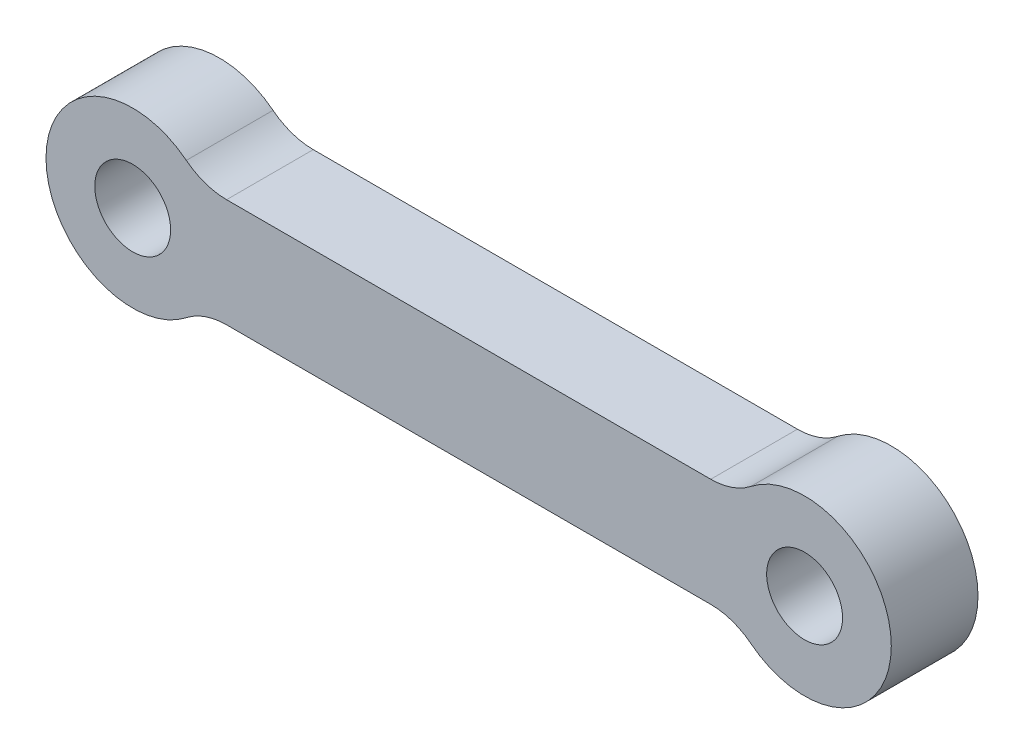
ISO-10303-21;
HEADER;
FILE_DESCRIPTION(('STEP AP214'),'2;1');
FILE_NAME('part.step','',(''),(''),'','','');
FILE_SCHEMA(('AUTOMOTIVE_DESIGN { 1 0 10303 214 1 1 1 1 }'));
ENDSEC;
DATA;
#1=APPLICATION_CONTEXT('core data for automotive mechanical design processes');
#2=APPLICATION_PROTOCOL_DEFINITION('international standard','automotive_design',2000,#1);
#3=PRODUCT_CONTEXT('',#1,'mechanical');
#4=PRODUCT('Part','Part','',(#3));
#5=PRODUCT_RELATED_PRODUCT_CATEGORY('part','',(#4));
#6=PRODUCT_DEFINITION_FORMATION('','',#4);
#7=PRODUCT_DEFINITION_CONTEXT('part definition',#1,'design');
#8=PRODUCT_DEFINITION('design','',#6,#7);
#9=PRODUCT_DEFINITION_SHAPE('','',#8);
#10=(LENGTH_UNIT() NAMED_UNIT(*) SI_UNIT(.MILLI.,.METRE.));
#11=(NAMED_UNIT(*) PLANE_ANGLE_UNIT() SI_UNIT($,.RADIAN.));
#12=(NAMED_UNIT(*) SI_UNIT($,.STERADIAN.) SOLID_ANGLE_UNIT());
#13=UNCERTAINTY_MEASURE_WITH_UNIT(LENGTH_MEASURE(1.E-05),#10,'distance_accuracy_value','');
#14=(GEOMETRIC_REPRESENTATION_CONTEXT(3) GLOBAL_UNCERTAINTY_ASSIGNED_CONTEXT((#13)) GLOBAL_UNIT_ASSIGNED_CONTEXT((#10,
#11,#12)) REPRESENTATION_CONTEXT('',''));
#15=CARTESIAN_POINT('',(0.,0.,0.));
#16=DIRECTION('',(0.,0.,1.));
#17=DIRECTION('',(1.,0.,0.));
#18=AXIS2_PLACEMENT_3D('',#15,#16,#17);
#19=CARTESIAN_POINT('',(0.,-2.5,4.));
#20=DIRECTION('',(0.,1.,0.));
#21=DIRECTION('',(0.,0.,1.));
#22=AXIS2_PLACEMENT_3D('',#19,#20,#21);
#23=PLANE('',#22);
#24=DIRECTION('',(1.,0.,0.));
#25=VECTOR('',#24,1.);
#26=CARTESIAN_POINT('',(0.,-2.5,0.));
#27=LINE('',#26,#25);
#28=CARTESIAN_POINT('',(4.33012701892219,-2.5,0.));
#29=VERTEX_POINT('',#28);
#30=CARTESIAN_POINT('',(26.6698729810778,-2.5,0.));
#31=VERTEX_POINT('',#30);
#32=EDGE_CURVE('E137',#29,#31,#27,.T.);
#33=ORIENTED_EDGE('',*,*,#32,.T.);
#34=DIRECTION('',(0.,0.,1.));
#35=VECTOR('',#34,1.);
#36=CARTESIAN_POINT('',(26.6698729810778,-2.5,4.));
#37=LINE('',#36,#35);
#38=CARTESIAN_POINT('',(26.6698729810778,-2.5,4.));
#39=VERTEX_POINT('',#38);
#40=EDGE_CURVE('E113',#31,#39,#37,.T.);
#41=ORIENTED_EDGE('',*,*,#40,.T.);
#42=DIRECTION('',(1.,0.,0.));
#43=VECTOR('',#42,1.);
#44=CARTESIAN_POINT('',(0.,-2.5,4.));
#45=LINE('',#44,#43);
#46=CARTESIAN_POINT('',(4.33012701892219,-2.5,4.));
#47=VERTEX_POINT('',#46);
#48=EDGE_CURVE('E157',#47,#39,#45,.T.);
#49=ORIENTED_EDGE('',*,*,#48,.F.);
#50=DIRECTION('',(0.,0.,1.));
#51=VECTOR('',#50,1.);
#52=CARTESIAN_POINT('',(4.33012701892219,-2.5,0.));
#53=LINE('',#52,#51);
#54=EDGE_CURVE('E129',#47,#29,#53,.F.);
#55=ORIENTED_EDGE('',*,*,#54,.T.);
#56=EDGE_LOOP('',(#33,#41,#49,#55));
#57=FACE_BOUND('',#56,.T.);
#58=ADVANCED_FACE('F42',(#57),#23,.F.);
#59=CARTESIAN_POINT('',(31.,0.,4.));
#60=DIRECTION('',(0.,0.,-1.));
#61=DIRECTION('',(-1.,0.,0.));
#62=AXIS2_PLACEMENT_3D('',#59,#60,#61);
#63=CYLINDRICAL_SURFACE('',#62,4.00000000000001);
#64=CARTESIAN_POINT('',(31.,0.,4.));
#65=DIRECTION('',(0.,0.,1.));
#66=DIRECTION('',(1.,0.,0.));
#67=AXIS2_PLACEMENT_3D('',#64,#65,#66);
#68=CIRCLE('',#67,4.00000000000001);
#69=CARTESIAN_POINT('',(28.525641703473,-3.14285714285714,4.));
#70=VERTEX_POINT('',#69);
#71=CARTESIAN_POINT('',(28.525641703473,3.14285714285714,4.));
#72=VERTEX_POINT('',#71);
#73=EDGE_CURVE('E127',#70,#72,#68,.T.);
#74=ORIENTED_EDGE('',*,*,#73,.F.);
#75=DIRECTION('',(0.,0.,-1.));
#76=VECTOR('',#75,1.);
#77=CARTESIAN_POINT('',(28.525641703473,-3.14285714285714,4.));
#78=LINE('',#77,#76);
#79=CARTESIAN_POINT('',(28.525641703473,-3.14285714285714,0.));
#80=VERTEX_POINT('',#79);
#81=EDGE_CURVE('E112',#70,#80,#78,.T.);
#82=ORIENTED_EDGE('',*,*,#81,.T.);
#83=CARTESIAN_POINT('',(31.,0.,0.));
#84=DIRECTION('',(0.,0.,1.));
#85=DIRECTION('',(1.,0.,0.));
#86=AXIS2_PLACEMENT_3D('',#83,#84,#85);
#87=CIRCLE('',#86,4.00000000000001);
#88=CARTESIAN_POINT('',(28.525641703473,3.14285714285714,0.));
#89=VERTEX_POINT('',#88);
#90=EDGE_CURVE('E125',#80,#89,#87,.T.);
#91=ORIENTED_EDGE('',*,*,#90,.T.);
#92=DIRECTION('',(0.,0.,-1.));
#93=VECTOR('',#92,1.);
#94=CARTESIAN_POINT('',(28.525641703473,3.14285714285714,4.));
#95=LINE('',#94,#93);
#96=EDGE_CURVE('E130',#89,#72,#95,.F.);
#97=ORIENTED_EDGE('',*,*,#96,.T.);
#98=EDGE_LOOP('',(#74,#82,#91,#97));
#99=FACE_BOUND('',#98,.T.);
#100=ADVANCED_FACE('F124',(#99),#63,.T.);
#101=CARTESIAN_POINT('',(0.,2.5,4.));
#102=DIRECTION('',(0.,1.,0.));
#103=DIRECTION('',(0.,0.,1.));
#104=AXIS2_PLACEMENT_3D('',#101,#102,#103);
#105=PLANE('',#104);
#106=DIRECTION('',(1.,0.,0.));
#107=VECTOR('',#106,1.);
#108=CARTESIAN_POINT('',(0.,2.5,0.));
#109=LINE('',#108,#107);
#110=CARTESIAN_POINT('',(4.33012701892219,2.5,0.));
#111=VERTEX_POINT('',#110);
#112=CARTESIAN_POINT('',(26.6698729810778,2.5,0.));
#113=VERTEX_POINT('',#112);
#114=EDGE_CURVE('E136',#111,#113,#109,.T.);
#115=ORIENTED_EDGE('',*,*,#114,.F.);
#116=DIRECTION('',(0.,0.,-1.));
#117=VECTOR('',#116,1.);
#118=CARTESIAN_POINT('',(4.33012701892219,2.5,4.));
#119=LINE('',#118,#117);
#120=CARTESIAN_POINT('',(4.33012701892219,2.5,4.));
#121=VERTEX_POINT('',#120);
#122=EDGE_CURVE('E63',#111,#121,#119,.F.);
#123=ORIENTED_EDGE('',*,*,#122,.T.);
#124=DIRECTION('',(1.,0.,0.));
#125=VECTOR('',#124,1.);
#126=CARTESIAN_POINT('',(0.,2.5,4.));
#127=LINE('',#126,#125);
#128=CARTESIAN_POINT('',(26.6698729810778,2.5,4.));
#129=VERTEX_POINT('',#128);
#130=EDGE_CURVE('E203',#121,#129,#127,.T.);
#131=ORIENTED_EDGE('',*,*,#130,.T.);
#132=DIRECTION('',(0.,0.,-1.));
#133=VECTOR('',#132,1.);
#134=CARTESIAN_POINT('',(26.6698729810778,2.5,4.));
#135=LINE('',#134,#133);
#136=EDGE_CURVE('E173',#129,#113,#135,.T.);
#137=ORIENTED_EDGE('',*,*,#136,.T.);
#138=EDGE_LOOP('',(#115,#123,#131,#137));
#139=FACE_BOUND('',#138,.T.);
#140=ADVANCED_FACE('F228',(#139),#105,.T.);
#141=CARTESIAN_POINT('',(0.,0.,4.));
#142=DIRECTION('',(0.,0.,-1.));
#143=DIRECTION('',(-1.,0.,0.));
#144=AXIS2_PLACEMENT_3D('',#141,#142,#143);
#145=CYLINDRICAL_SURFACE('',#144,1.75);
#146=CARTESIAN_POINT('',(0.,0.,4.));
#147=DIRECTION('',(0.,0.,1.));
#148=DIRECTION('',(1.,0.,0.));
#149=AXIS2_PLACEMENT_3D('',#146,#147,#148);
#150=CIRCLE('',#149,1.75);
#151=CARTESIAN_POINT('',(1.75,0.,4.));
#152=VERTEX_POINT('',#151);
#153=EDGE_CURVE('E196',#152,#152,#150,.T.);
#154=ORIENTED_EDGE('',*,*,#153,.T.);
#155=EDGE_LOOP('',(#154));
#156=FACE_BOUND('',#155,.T.);
#157=CARTESIAN_POINT('',(0.,0.,0.));
#158=DIRECTION('',(0.,0.,1.));
#159=DIRECTION('',(1.,0.,0.));
#160=AXIS2_PLACEMENT_3D('',#157,#158,#159);
#161=CIRCLE('',#160,1.75);
#162=CARTESIAN_POINT('',(1.75,0.,0.));
#163=VERTEX_POINT('',#162);
#164=EDGE_CURVE('E149',#163,#163,#161,.T.);
#165=ORIENTED_EDGE('',*,*,#164,.F.);
#166=EDGE_LOOP('',(#165));
#167=FACE_BOUND('',#166,.T.);
#168=ADVANCED_FACE('F308',(#156,#167),#145,.F.);
#169=CARTESIAN_POINT('',(0.,0.,4.));
#170=DIRECTION('',(0.,0.,-1.));
#171=DIRECTION('',(-1.,0.,0.));
#172=AXIS2_PLACEMENT_3D('',#169,#170,#171);
#173=CYLINDRICAL_SURFACE('',#172,4.);
#174=CARTESIAN_POINT('',(0.,0.,0.));
#175=DIRECTION('',(0.,0.,1.));
#176=DIRECTION('',(1.,0.,0.));
#177=AXIS2_PLACEMENT_3D('',#174,#175,#176);
#178=CIRCLE('',#177,4.);
#179=CARTESIAN_POINT('',(2.47435829652697,3.14285714285714,0.));
#180=VERTEX_POINT('',#179);
#181=CARTESIAN_POINT('',(2.47435829652697,-3.14285714285714,0.));
#182=VERTEX_POINT('',#181);
#183=EDGE_CURVE('E141',#180,#182,#178,.T.);
#184=ORIENTED_EDGE('',*,*,#183,.T.);
#185=DIRECTION('',(0.,0.,-1.));
#186=VECTOR('',#185,1.);
#187=CARTESIAN_POINT('',(2.47435829652697,-3.14285714285714,4.));
#188=LINE('',#187,#186);
#189=CARTESIAN_POINT('',(2.47435829652697,-3.14285714285714,4.));
#190=VERTEX_POINT('',#189);
#191=EDGE_CURVE('E170',#182,#190,#188,.F.);
#192=ORIENTED_EDGE('',*,*,#191,.T.);
#193=CARTESIAN_POINT('',(0.,0.,4.));
#194=DIRECTION('',(0.,0.,1.));
#195=DIRECTION('',(1.,0.,0.));
#196=AXIS2_PLACEMENT_3D('',#193,#194,#195);
#197=CIRCLE('',#196,4.);
#198=CARTESIAN_POINT('',(2.47435829652697,3.14285714285714,4.));
#199=VERTEX_POINT('',#198);
#200=EDGE_CURVE('E199',#199,#190,#197,.T.);
#201=ORIENTED_EDGE('',*,*,#200,.F.);
#202=DIRECTION('',(0.,0.,-1.));
#203=VECTOR('',#202,1.);
#204=CARTESIAN_POINT('',(2.47435829652697,3.14285714285714,4.));
#205=LINE('',#204,#203);
#206=EDGE_CURVE('E166',#199,#180,#205,.T.);
#207=ORIENTED_EDGE('',*,*,#206,.T.);
#208=EDGE_LOOP('',(#184,#192,#201,#207));
#209=FACE_BOUND('',#208,.T.);
#210=ADVANCED_FACE('F222',(#209),#173,.T.);
#211=CARTESIAN_POINT('',(31.,0.,4.));
#212=DIRECTION('',(0.,0.,-1.));
#213=DIRECTION('',(-1.,0.,0.));
#214=AXIS2_PLACEMENT_3D('',#211,#212,#213);
#215=CYLINDRICAL_SURFACE('',#214,1.75);
#216=CARTESIAN_POINT('',(31.,0.,4.));
#217=DIRECTION('',(0.,0.,1.));
#218=DIRECTION('',(1.,0.,0.));
#219=AXIS2_PLACEMENT_3D('',#216,#217,#218);
#220=CIRCLE('',#219,1.75);
#221=CARTESIAN_POINT('',(32.75,0.,4.));
#222=VERTEX_POINT('',#221);
#223=EDGE_CURVE('E159',#222,#222,#220,.T.);
#224=ORIENTED_EDGE('',*,*,#223,.T.);
#225=EDGE_LOOP('',(#224));
#226=FACE_BOUND('',#225,.T.);
#227=CARTESIAN_POINT('',(31.,0.,0.));
#228=DIRECTION('',(0.,0.,1.));
#229=DIRECTION('',(1.,0.,0.));
#230=AXIS2_PLACEMENT_3D('',#227,#228,#229);
#231=CIRCLE('',#230,1.75);
#232=CARTESIAN_POINT('',(32.75,0.,0.));
#233=VERTEX_POINT('',#232);
#234=EDGE_CURVE('E153',#233,#233,#231,.T.);
#235=ORIENTED_EDGE('',*,*,#234,.F.);
#236=EDGE_LOOP('',(#235));
#237=FACE_BOUND('',#236,.T.);
#238=ADVANCED_FACE('F290',(#226,#237),#215,.F.);
#239=CARTESIAN_POINT('',(0.,0.,4.));
#240=DIRECTION('',(0.,0.,1.));
#241=DIRECTION('',(1.,0.,0.));
#242=AXIS2_PLACEMENT_3D('',#239,#240,#241);
#243=PLANE('',#242);
#244=ORIENTED_EDGE('',*,*,#200,.T.);
#245=CARTESIAN_POINT('',(4.33012701892219,-5.5,4.));
#246=DIRECTION('',(0.,0.,1.));
#247=DIRECTION('',(1.,0.,0.));
#248=AXIS2_PLACEMENT_3D('',#245,#246,#247);
#249=CIRCLE('',#248,3.);
#250=EDGE_CURVE('E184',#190,#47,#249,.F.);
#251=ORIENTED_EDGE('',*,*,#250,.T.);
#252=ORIENTED_EDGE('',*,*,#48,.T.);
#253=CARTESIAN_POINT('',(26.6698729810778,-5.5,4.));
#254=DIRECTION('',(0.,0.,1.));
#255=DIRECTION('',(1.,0.,0.));
#256=AXIS2_PLACEMENT_3D('',#253,#254,#255);
#257=CIRCLE('',#256,3.);
#258=EDGE_CURVE('E119',#39,#70,#257,.F.);
#259=ORIENTED_EDGE('',*,*,#258,.T.);
#260=ORIENTED_EDGE('',*,*,#73,.T.);
#261=CARTESIAN_POINT('',(26.6698729810778,5.5,4.));
#262=DIRECTION('',(0.,0.,1.));
#263=DIRECTION('',(1.,0.,0.));
#264=AXIS2_PLACEMENT_3D('',#261,#262,#263);
#265=CIRCLE('',#264,3.);
#266=EDGE_CURVE('E11',#72,#129,#265,.F.);
#267=ORIENTED_EDGE('',*,*,#266,.T.);
#268=ORIENTED_EDGE('',*,*,#130,.F.);
#269=CARTESIAN_POINT('',(4.33012701892219,5.5,4.));
#270=DIRECTION('',(0.,0.,1.));
#271=DIRECTION('',(1.,0.,0.));
#272=AXIS2_PLACEMENT_3D('',#269,#270,#271);
#273=CIRCLE('',#272,3.);
#274=EDGE_CURVE('E190',#121,#199,#273,.F.);
#275=ORIENTED_EDGE('',*,*,#274,.T.);
#276=EDGE_LOOP('',(#244,#251,#252,#259,#260,#267,#268,#275));
#277=FACE_BOUND('',#276,.T.);
#278=ORIENTED_EDGE('',*,*,#153,.F.);
#279=EDGE_LOOP('',(#278));
#280=FACE_BOUND('',#279,.T.);
#281=ORIENTED_EDGE('',*,*,#223,.F.);
#282=EDGE_LOOP('',(#281));
#283=FACE_BOUND('',#282,.T.);
#284=ADVANCED_FACE('F212',(#277,#280,#283),#243,.T.);
#285=CARTESIAN_POINT('',(0.,0.,0.));
#286=DIRECTION('',(0.,0.,1.));
#287=DIRECTION('',(1.,0.,0.));
#288=AXIS2_PLACEMENT_3D('',#285,#286,#287);
#289=PLANE('',#288);
#290=ORIENTED_EDGE('',*,*,#32,.F.);
#291=CARTESIAN_POINT('',(4.33012701892219,-5.5,0.));
#292=DIRECTION('',(0.,0.,1.));
#293=DIRECTION('',(1.,0.,0.));
#294=AXIS2_PLACEMENT_3D('',#291,#292,#293);
#295=CIRCLE('',#294,3.);
#296=EDGE_CURVE('E181',#29,#182,#295,.T.);
#297=ORIENTED_EDGE('',*,*,#296,.T.);
#298=ORIENTED_EDGE('',*,*,#183,.F.);
#299=CARTESIAN_POINT('',(4.33012701892219,5.5,0.));
#300=DIRECTION('',(0.,0.,1.));
#301=DIRECTION('',(1.,0.,0.));
#302=AXIS2_PLACEMENT_3D('',#299,#300,#301);
#303=CIRCLE('',#302,3.);
#304=EDGE_CURVE('E187',#180,#111,#303,.T.);
#305=ORIENTED_EDGE('',*,*,#304,.T.);
#306=ORIENTED_EDGE('',*,*,#114,.T.);
#307=CARTESIAN_POINT('',(26.6698729810778,5.5,0.));
#308=DIRECTION('',(0.,0.,1.));
#309=DIRECTION('',(1.,0.,0.));
#310=AXIS2_PLACEMENT_3D('',#307,#308,#309);
#311=CIRCLE('',#310,3.);
#312=EDGE_CURVE('E51',#113,#89,#311,.T.);
#313=ORIENTED_EDGE('',*,*,#312,.T.);
#314=ORIENTED_EDGE('',*,*,#90,.F.);
#315=CARTESIAN_POINT('',(26.6698729810778,-5.5,0.));
#316=DIRECTION('',(0.,0.,1.));
#317=DIRECTION('',(1.,0.,0.));
#318=AXIS2_PLACEMENT_3D('',#315,#316,#317);
#319=CIRCLE('',#318,3.);
#320=EDGE_CURVE('E108',#80,#31,#319,.T.);
#321=ORIENTED_EDGE('',*,*,#320,.T.);
#322=EDGE_LOOP('',(#290,#297,#298,#305,#306,#313,#314,#321));
#323=FACE_BOUND('',#322,.T.);
#324=ORIENTED_EDGE('',*,*,#164,.T.);
#325=EDGE_LOOP('',(#324));
#326=FACE_BOUND('',#325,.T.);
#327=ORIENTED_EDGE('',*,*,#234,.T.);
#328=EDGE_LOOP('',(#327));
#329=FACE_BOUND('',#328,.T.);
#330=ADVANCED_FACE('F132',(#323,#326,#329),#289,.F.);
#331=CARTESIAN_POINT('',(26.6698729810778,-5.5,4.));
#332=DIRECTION('',(0.,0.,-1.));
#333=DIRECTION('',(-1.,0.,0.));
#334=AXIS2_PLACEMENT_3D('',#331,#332,#333);
#335=CYLINDRICAL_SURFACE('',#334,3.);
#336=ORIENTED_EDGE('',*,*,#258,.F.);
#337=ORIENTED_EDGE('',*,*,#40,.F.);
#338=ORIENTED_EDGE('',*,*,#320,.F.);
#339=ORIENTED_EDGE('',*,*,#81,.F.);
#340=EDGE_LOOP('',(#336,#337,#338,#339));
#341=FACE_BOUND('',#340,.T.);
#342=ADVANCED_FACE('F111',(#341),#335,.F.);
#343=CARTESIAN_POINT('',(4.33012701892219,-5.5,4.));
#344=DIRECTION('',(0.,0.,-1.));
#345=DIRECTION('',(-1.,0.,0.));
#346=AXIS2_PLACEMENT_3D('',#343,#344,#345);
#347=CYLINDRICAL_SURFACE('',#346,3.);
#348=ORIENTED_EDGE('',*,*,#250,.F.);
#349=ORIENTED_EDGE('',*,*,#191,.F.);
#350=ORIENTED_EDGE('',*,*,#296,.F.);
#351=ORIENTED_EDGE('',*,*,#54,.F.);
#352=EDGE_LOOP('',(#348,#349,#350,#351));
#353=FACE_BOUND('',#352,.T.);
#354=ADVANCED_FACE('F218',(#353),#347,.F.);
#355=CARTESIAN_POINT('',(4.33012701892219,5.5,4.));
#356=DIRECTION('',(0.,0.,-1.));
#357=DIRECTION('',(-1.,0.,0.));
#358=AXIS2_PLACEMENT_3D('',#355,#356,#357);
#359=CYLINDRICAL_SURFACE('',#358,3.);
#360=ORIENTED_EDGE('',*,*,#274,.F.);
#361=ORIENTED_EDGE('',*,*,#122,.F.);
#362=ORIENTED_EDGE('',*,*,#304,.F.);
#363=ORIENTED_EDGE('',*,*,#206,.F.);
#364=EDGE_LOOP('',(#360,#361,#362,#363));
#365=FACE_BOUND('',#364,.T.);
#366=ADVANCED_FACE('F227',(#365),#359,.F.);
#367=CARTESIAN_POINT('',(26.6698729810778,5.5,4.));
#368=DIRECTION('',(0.,0.,-1.));
#369=DIRECTION('',(-1.,0.,0.));
#370=AXIS2_PLACEMENT_3D('',#367,#368,#369);
#371=CYLINDRICAL_SURFACE('',#370,3.);
#372=ORIENTED_EDGE('',*,*,#266,.F.);
#373=ORIENTED_EDGE('',*,*,#96,.F.);
#374=ORIENTED_EDGE('',*,*,#312,.F.);
#375=ORIENTED_EDGE('',*,*,#136,.F.);
#376=EDGE_LOOP('',(#372,#373,#374,#375));
#377=FACE_BOUND('',#376,.T.);
#378=ADVANCED_FACE('F44',(#377),#371,.F.);
#379=CLOSED_SHELL('',(#58,#100,#140,#168,#210,#238,#284,#330,#342,#354,#366,#378));
#380=MANIFOLD_SOLID_BREP('B2',#379);
#381=ADVANCED_BREP_SHAPE_REPRESENTATION('',(#18,#380),#14);
#382=SHAPE_DEFINITION_REPRESENTATION(#9,#381);
ENDSEC;
END-ISO-10303-21;
